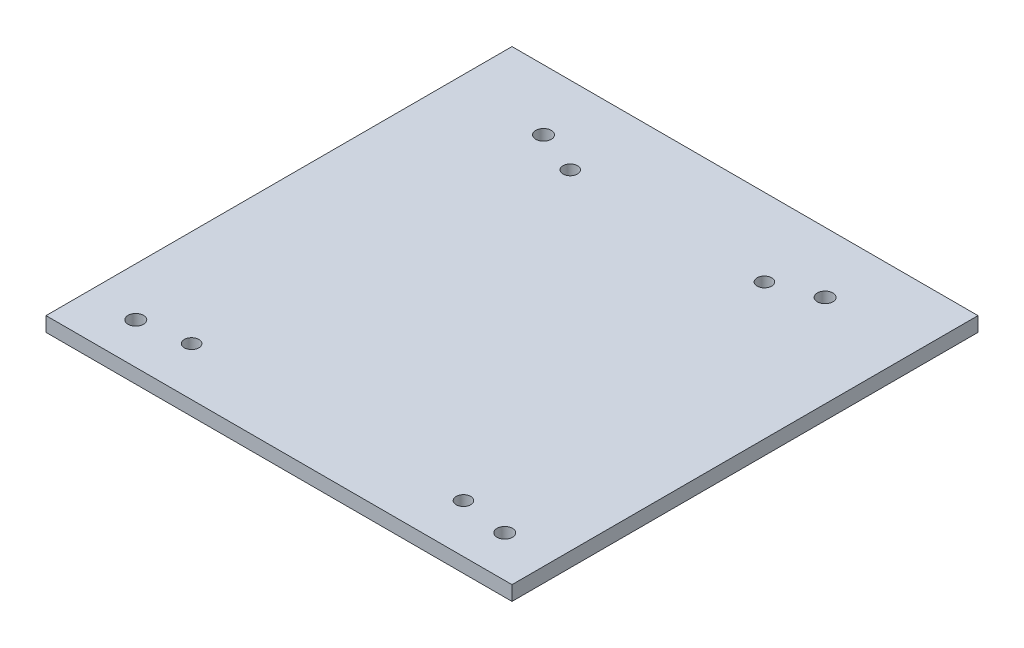
ISO-10303-21;
HEADER;
FILE_DESCRIPTION(('STEP AP214'),'2;1');
FILE_NAME('part.step','',(''),(''),'','','');
FILE_SCHEMA(('AUTOMOTIVE_DESIGN { 1 0 10303 214 1 1 1 1 }'));
ENDSEC;
DATA;
#1=APPLICATION_CONTEXT('core data for automotive mechanical design processes');
#2=APPLICATION_PROTOCOL_DEFINITION('international standard','automotive_design',2000,#1);
#3=PRODUCT_CONTEXT('',#1,'mechanical');
#4=PRODUCT('Part','Part','',(#3));
#5=PRODUCT_RELATED_PRODUCT_CATEGORY('part','',(#4));
#6=PRODUCT_DEFINITION_FORMATION('','',#4);
#7=PRODUCT_DEFINITION_CONTEXT('part definition',#1,'design');
#8=PRODUCT_DEFINITION('design','',#6,#7);
#9=PRODUCT_DEFINITION_SHAPE('','',#8);
#10=(LENGTH_UNIT() NAMED_UNIT(*) SI_UNIT(.MILLI.,.METRE.));
#11=(NAMED_UNIT(*) PLANE_ANGLE_UNIT() SI_UNIT($,.RADIAN.));
#12=(NAMED_UNIT(*) SI_UNIT($,.STERADIAN.) SOLID_ANGLE_UNIT());
#13=UNCERTAINTY_MEASURE_WITH_UNIT(LENGTH_MEASURE(1.E-05),#10,'distance_accuracy_value','');
#14=(GEOMETRIC_REPRESENTATION_CONTEXT(3) GLOBAL_UNCERTAINTY_ASSIGNED_CONTEXT((#13)) GLOBAL_UNIT_ASSIGNED_CONTEXT((#10,
#11,#12)) REPRESENTATION_CONTEXT('',''));
#15=CARTESIAN_POINT('',(0.,0.,0.));
#16=DIRECTION('',(0.,0.,1.));
#17=DIRECTION('',(1.,0.,0.));
#18=AXIS2_PLACEMENT_3D('',#15,#16,#17);
#19=CARTESIAN_POINT('',(0.,3.,0.));
#20=DIRECTION('',(0.,-1.,0.));
#21=DIRECTION('',(0.,0.,-1.));
#22=AXIS2_PLACEMENT_3D('',#19,#20,#21);
#23=PLANE('',#22);
#24=DIRECTION('',(0.,0.,1.));
#25=VECTOR('',#24,1.);
#26=CARTESIAN_POINT('',(0.,3.,0.));
#27=LINE('',#26,#25);
#28=CARTESIAN_POINT('',(0.,3.,-96.));
#29=VERTEX_POINT('',#28);
#30=CARTESIAN_POINT('',(0.,3.,0.));
#31=VERTEX_POINT('',#30);
#32=EDGE_CURVE('E92',#29,#31,#27,.T.);
#33=ORIENTED_EDGE('',*,*,#32,.T.);
#34=DIRECTION('',(1.,0.,0.));
#35=VECTOR('',#34,1.);
#36=CARTESIAN_POINT('',(0.,3.,0.));
#37=LINE('',#36,#35);
#38=CARTESIAN_POINT('',(96.,3.,0.));
#39=VERTEX_POINT('',#38);
#40=EDGE_CURVE('E87',#31,#39,#37,.T.);
#41=ORIENTED_EDGE('',*,*,#40,.T.);
#42=DIRECTION('',(0.,0.,-1.));
#43=VECTOR('',#42,1.);
#44=CARTESIAN_POINT('',(96.,3.,0.));
#45=LINE('',#44,#43);
#46=CARTESIAN_POINT('',(96.,3.,-96.));
#47=VERTEX_POINT('',#46);
#48=EDGE_CURVE('E90',#39,#47,#45,.T.);
#49=ORIENTED_EDGE('',*,*,#48,.T.);
#50=DIRECTION('',(-1.,0.,0.));
#51=VECTOR('',#50,1.);
#52=CARTESIAN_POINT('',(0.,3.,-96.));
#53=LINE('',#52,#51);
#54=EDGE_CURVE('E57',#47,#29,#53,.T.);
#55=ORIENTED_EDGE('',*,*,#54,.T.);
#56=EDGE_LOOP('',(#33,#41,#49,#55));
#57=FACE_BOUND('',#56,.T.);
#58=CARTESIAN_POINT('',(19.,3.,-83.5));
#59=DIRECTION('',(0.,1.,0.));
#60=DIRECTION('',(0.,0.,1.));
#61=AXIS2_PLACEMENT_3D('',#58,#59,#60);
#62=CIRCLE('',#61,1.60000000000001);
#63=CARTESIAN_POINT('',(19.,3.,-81.9));
#64=VERTEX_POINT('',#63);
#65=EDGE_CURVE('E112',#64,#64,#62,.T.);
#66=ORIENTED_EDGE('',*,*,#65,.F.);
#67=EDGE_LOOP('',(#66));
#68=FACE_BOUND('',#67,.T.);
#69=CARTESIAN_POINT('',(77.,3.,-83.5));
#70=DIRECTION('',(0.,1.,0.));
#71=DIRECTION('',(0.,0.,1.));
#72=AXIS2_PLACEMENT_3D('',#69,#70,#71);
#73=CIRCLE('',#72,1.60000000000001);
#74=CARTESIAN_POINT('',(77.,3.,-81.9));
#75=VERTEX_POINT('',#74);
#76=EDGE_CURVE('E134',#75,#75,#73,.T.);
#77=ORIENTED_EDGE('',*,*,#76,.F.);
#78=EDGE_LOOP('',(#77));
#79=FACE_BOUND('',#78,.T.);
#80=CARTESIAN_POINT('',(10.,3.,-8.50000000000001));
#81=DIRECTION('',(0.,1.,0.));
#82=DIRECTION('',(0.,0.,1.));
#83=AXIS2_PLACEMENT_3D('',#80,#81,#82);
#84=CIRCLE('',#83,1.6);
#85=CARTESIAN_POINT('',(10.,3.,-6.90000000000001));
#86=VERTEX_POINT('',#85);
#87=EDGE_CURVE('E142',#86,#86,#84,.T.);
#88=ORIENTED_EDGE('',*,*,#87,.F.);
#89=EDGE_LOOP('',(#88));
#90=FACE_BOUND('',#89,.T.);
#91=CARTESIAN_POINT('',(86.,3.,-8.50000000000001));
#92=DIRECTION('',(0.,1.,0.));
#93=DIRECTION('',(0.,0.,1.));
#94=AXIS2_PLACEMENT_3D('',#91,#92,#93);
#95=CIRCLE('',#94,1.6);
#96=CARTESIAN_POINT('',(86.,3.,-6.9));
#97=VERTEX_POINT('',#96);
#98=EDGE_CURVE('E150',#97,#97,#95,.T.);
#99=ORIENTED_EDGE('',*,*,#98,.F.);
#100=EDGE_LOOP('',(#99));
#101=FACE_BOUND('',#100,.T.);
#102=CARTESIAN_POINT('',(28.,3.,-80.));
#103=DIRECTION('',(0.,1.,0.));
#104=DIRECTION('',(0.,0.,1.));
#105=AXIS2_PLACEMENT_3D('',#102,#103,#104);
#106=CIRCLE('',#105,1.5);
#107=CARTESIAN_POINT('',(28.,3.,-78.5));
#108=VERTEX_POINT('',#107);
#109=EDGE_CURVE('E158',#108,#108,#106,.T.);
#110=ORIENTED_EDGE('',*,*,#109,.F.);
#111=EDGE_LOOP('',(#110));
#112=FACE_BOUND('',#111,.T.);
#113=CARTESIAN_POINT('',(68.,3.,-80.));
#114=DIRECTION('',(0.,1.,0.));
#115=DIRECTION('',(0.,0.,1.));
#116=AXIS2_PLACEMENT_3D('',#113,#114,#115);
#117=CIRCLE('',#116,1.5);
#118=CARTESIAN_POINT('',(68.,3.,-78.5));
#119=VERTEX_POINT('',#118);
#120=EDGE_CURVE('E166',#119,#119,#117,.T.);
#121=ORIENTED_EDGE('',*,*,#120,.F.);
#122=EDGE_LOOP('',(#121));
#123=FACE_BOUND('',#122,.T.);
#124=CARTESIAN_POINT('',(20.,3.,-10.));
#125=DIRECTION('',(0.,1.,0.));
#126=DIRECTION('',(0.,0.,1.));
#127=AXIS2_PLACEMENT_3D('',#124,#125,#126);
#128=CIRCLE('',#127,1.5);
#129=CARTESIAN_POINT('',(20.,3.,-8.49999999999999));
#130=VERTEX_POINT('',#129);
#131=EDGE_CURVE('E174',#130,#130,#128,.T.);
#132=ORIENTED_EDGE('',*,*,#131,.F.);
#133=EDGE_LOOP('',(#132));
#134=FACE_BOUND('',#133,.T.);
#135=CARTESIAN_POINT('',(76.,3.,-10.));
#136=DIRECTION('',(0.,1.,0.));
#137=DIRECTION('',(0.,0.,1.));
#138=AXIS2_PLACEMENT_3D('',#135,#136,#137);
#139=CIRCLE('',#138,1.5);
#140=CARTESIAN_POINT('',(76.,3.,-8.5));
#141=VERTEX_POINT('',#140);
#142=EDGE_CURVE('E182',#141,#141,#139,.T.);
#143=ORIENTED_EDGE('',*,*,#142,.F.);
#144=EDGE_LOOP('',(#143));
#145=FACE_BOUND('',#144,.T.);
#146=ADVANCED_FACE('F39',(#57,#68,#79,#90,#101,#112,#123,#134,#145),#23,.F.);
#147=CARTESIAN_POINT('',(0.,0.,0.));
#148=DIRECTION('',(0.,-1.,0.));
#149=DIRECTION('',(0.,0.,-1.));
#150=AXIS2_PLACEMENT_3D('',#147,#148,#149);
#151=PLANE('',#150);
#152=CARTESIAN_POINT('',(20.,0.,-10.));
#153=DIRECTION('',(0.,1.,0.));
#154=DIRECTION('',(0.,0.,1.));
#155=AXIS2_PLACEMENT_3D('',#152,#153,#154);
#156=CIRCLE('',#155,1.5);
#157=CARTESIAN_POINT('',(20.,0.,-8.49999999999999));
#158=VERTEX_POINT('',#157);
#159=EDGE_CURVE('E178',#158,#158,#156,.T.);
#160=ORIENTED_EDGE('',*,*,#159,.T.);
#161=EDGE_LOOP('',(#160));
#162=FACE_BOUND('',#161,.T.);
#163=CARTESIAN_POINT('',(28.,0.,-80.));
#164=DIRECTION('',(0.,1.,0.));
#165=DIRECTION('',(0.,0.,1.));
#166=AXIS2_PLACEMENT_3D('',#163,#164,#165);
#167=CIRCLE('',#166,1.5);
#168=CARTESIAN_POINT('',(28.,0.,-78.5));
#169=VERTEX_POINT('',#168);
#170=EDGE_CURVE('E162',#169,#169,#167,.T.);
#171=ORIENTED_EDGE('',*,*,#170,.T.);
#172=EDGE_LOOP('',(#171));
#173=FACE_BOUND('',#172,.T.);
#174=CARTESIAN_POINT('',(10.,0.,-8.50000000000001));
#175=DIRECTION('',(0.,1.,0.));
#176=DIRECTION('',(0.,0.,1.));
#177=AXIS2_PLACEMENT_3D('',#174,#175,#176);
#178=CIRCLE('',#177,1.6);
#179=CARTESIAN_POINT('',(10.,0.,-6.90000000000001));
#180=VERTEX_POINT('',#179);
#181=EDGE_CURVE('E146',#180,#180,#178,.T.);
#182=ORIENTED_EDGE('',*,*,#181,.T.);
#183=EDGE_LOOP('',(#182));
#184=FACE_BOUND('',#183,.T.);
#185=CARTESIAN_POINT('',(19.,0.,-83.5));
#186=DIRECTION('',(0.,1.,0.));
#187=DIRECTION('',(0.,0.,1.));
#188=AXIS2_PLACEMENT_3D('',#185,#186,#187);
#189=CIRCLE('',#188,1.60000000000001);
#190=CARTESIAN_POINT('',(19.,0.,-81.9));
#191=VERTEX_POINT('',#190);
#192=EDGE_CURVE('E130',#191,#191,#189,.T.);
#193=ORIENTED_EDGE('',*,*,#192,.T.);
#194=EDGE_LOOP('',(#193));
#195=FACE_BOUND('',#194,.T.);
#196=DIRECTION('',(0.,0.,1.));
#197=VECTOR('',#196,1.);
#198=CARTESIAN_POINT('',(0.,0.,0.));
#199=LINE('',#198,#197);
#200=CARTESIAN_POINT('',(0.,0.,-96.));
#201=VERTEX_POINT('',#200);
#202=CARTESIAN_POINT('',(0.,0.,0.));
#203=VERTEX_POINT('',#202);
#204=EDGE_CURVE('E108',#201,#203,#199,.T.);
#205=ORIENTED_EDGE('',*,*,#204,.F.);
#206=DIRECTION('',(-1.,0.,0.));
#207=VECTOR('',#206,1.);
#208=CARTESIAN_POINT('',(0.,0.,-96.));
#209=LINE('',#208,#207);
#210=CARTESIAN_POINT('',(96.,0.,-96.));
#211=VERTEX_POINT('',#210);
#212=EDGE_CURVE('E80',#211,#201,#209,.T.);
#213=ORIENTED_EDGE('',*,*,#212,.F.);
#214=DIRECTION('',(0.,0.,-1.));
#215=VECTOR('',#214,1.);
#216=CARTESIAN_POINT('',(96.,0.,0.));
#217=LINE('',#216,#215);
#218=CARTESIAN_POINT('',(96.,0.,0.));
#219=VERTEX_POINT('',#218);
#220=EDGE_CURVE('E74',#219,#211,#217,.T.);
#221=ORIENTED_EDGE('',*,*,#220,.F.);
#222=DIRECTION('',(1.,0.,0.));
#223=VECTOR('',#222,1.);
#224=CARTESIAN_POINT('',(0.,0.,0.));
#225=LINE('',#224,#223);
#226=EDGE_CURVE('E97',#203,#219,#225,.T.);
#227=ORIENTED_EDGE('',*,*,#226,.F.);
#228=EDGE_LOOP('',(#205,#213,#221,#227));
#229=FACE_BOUND('',#228,.T.);
#230=CARTESIAN_POINT('',(77.,0.,-83.5));
#231=DIRECTION('',(0.,1.,0.));
#232=DIRECTION('',(0.,0.,1.));
#233=AXIS2_PLACEMENT_3D('',#230,#231,#232);
#234=CIRCLE('',#233,1.60000000000001);
#235=CARTESIAN_POINT('',(77.,0.,-81.9));
#236=VERTEX_POINT('',#235);
#237=EDGE_CURVE('E138',#236,#236,#234,.T.);
#238=ORIENTED_EDGE('',*,*,#237,.T.);
#239=EDGE_LOOP('',(#238));
#240=FACE_BOUND('',#239,.T.);
#241=CARTESIAN_POINT('',(86.,0.,-8.50000000000001));
#242=DIRECTION('',(0.,1.,0.));
#243=DIRECTION('',(0.,0.,1.));
#244=AXIS2_PLACEMENT_3D('',#241,#242,#243);
#245=CIRCLE('',#244,1.6);
#246=CARTESIAN_POINT('',(86.,0.,-6.9));
#247=VERTEX_POINT('',#246);
#248=EDGE_CURVE('E154',#247,#247,#245,.T.);
#249=ORIENTED_EDGE('',*,*,#248,.T.);
#250=EDGE_LOOP('',(#249));
#251=FACE_BOUND('',#250,.T.);
#252=CARTESIAN_POINT('',(68.,0.,-80.));
#253=DIRECTION('',(0.,1.,0.));
#254=DIRECTION('',(0.,0.,1.));
#255=AXIS2_PLACEMENT_3D('',#252,#253,#254);
#256=CIRCLE('',#255,1.5);
#257=CARTESIAN_POINT('',(68.,0.,-78.5));
#258=VERTEX_POINT('',#257);
#259=EDGE_CURVE('E170',#258,#258,#256,.T.);
#260=ORIENTED_EDGE('',*,*,#259,.T.);
#261=EDGE_LOOP('',(#260));
#262=FACE_BOUND('',#261,.T.);
#263=CARTESIAN_POINT('',(76.,0.,-10.));
#264=DIRECTION('',(0.,1.,0.));
#265=DIRECTION('',(0.,0.,1.));
#266=AXIS2_PLACEMENT_3D('',#263,#264,#265);
#267=CIRCLE('',#266,1.5);
#268=CARTESIAN_POINT('',(76.,0.,-8.5));
#269=VERTEX_POINT('',#268);
#270=EDGE_CURVE('E186',#269,#269,#267,.T.);
#271=ORIENTED_EDGE('',*,*,#270,.T.);
#272=EDGE_LOOP('',(#271));
#273=FACE_BOUND('',#272,.T.);
#274=ADVANCED_FACE('F125',(#162,#173,#184,#195,#229,#240,#251,#262,#273),#151,.T.);
#275=CARTESIAN_POINT('',(0.,3.,0.));
#276=DIRECTION('',(1.,0.,0.));
#277=DIRECTION('',(0.,0.,-1.));
#278=AXIS2_PLACEMENT_3D('',#275,#276,#277);
#279=PLANE('',#278);
#280=ORIENTED_EDGE('',*,*,#204,.T.);
#281=DIRECTION('',(0.,-1.,0.));
#282=VECTOR('',#281,1.);
#283=CARTESIAN_POINT('',(0.,3.,0.));
#284=LINE('',#283,#282);
#285=EDGE_CURVE('E11',#31,#203,#284,.T.);
#286=ORIENTED_EDGE('',*,*,#285,.F.);
#287=ORIENTED_EDGE('',*,*,#32,.F.);
#288=DIRECTION('',(0.,-1.,0.));
#289=VECTOR('',#288,1.);
#290=CARTESIAN_POINT('',(0.,3.,-96.));
#291=LINE('',#290,#289);
#292=EDGE_CURVE('E104',#29,#201,#291,.T.);
#293=ORIENTED_EDGE('',*,*,#292,.T.);
#294=EDGE_LOOP('',(#280,#286,#287,#293));
#295=FACE_BOUND('',#294,.T.);
#296=ADVANCED_FACE('F41',(#295),#279,.F.);
#297=CARTESIAN_POINT('',(0.,3.,0.));
#298=DIRECTION('',(0.,0.,-1.));
#299=DIRECTION('',(-1.,0.,0.));
#300=AXIS2_PLACEMENT_3D('',#297,#298,#299);
#301=PLANE('',#300);
#302=ORIENTED_EDGE('',*,*,#226,.T.);
#303=DIRECTION('',(0.,-1.,0.));
#304=VECTOR('',#303,1.);
#305=CARTESIAN_POINT('',(96.,3.,0.));
#306=LINE('',#305,#304);
#307=EDGE_CURVE('E49',#39,#219,#306,.T.);
#308=ORIENTED_EDGE('',*,*,#307,.F.);
#309=ORIENTED_EDGE('',*,*,#40,.F.);
#310=ORIENTED_EDGE('',*,*,#285,.T.);
#311=EDGE_LOOP('',(#302,#308,#309,#310));
#312=FACE_BOUND('',#311,.T.);
#313=ADVANCED_FACE('F96',(#312),#301,.F.);
#314=CARTESIAN_POINT('',(96.,3.,0.));
#315=DIRECTION('',(-1.,0.,0.));
#316=DIRECTION('',(0.,0.,1.));
#317=AXIS2_PLACEMENT_3D('',#314,#315,#316);
#318=PLANE('',#317);
#319=ORIENTED_EDGE('',*,*,#220,.T.);
#320=DIRECTION('',(0.,-1.,0.));
#321=VECTOR('',#320,1.);
#322=CARTESIAN_POINT('',(96.,3.,-96.));
#323=LINE('',#322,#321);
#324=EDGE_CURVE('E99',#47,#211,#323,.T.);
#325=ORIENTED_EDGE('',*,*,#324,.F.);
#326=ORIENTED_EDGE('',*,*,#48,.F.);
#327=ORIENTED_EDGE('',*,*,#307,.T.);
#328=EDGE_LOOP('',(#319,#325,#326,#327));
#329=FACE_BOUND('',#328,.T.);
#330=ADVANCED_FACE('F100',(#329),#318,.F.);
#331=CARTESIAN_POINT('',(0.,3.,-96.));
#332=DIRECTION('',(0.,0.,1.));
#333=DIRECTION('',(1.,0.,0.));
#334=AXIS2_PLACEMENT_3D('',#331,#332,#333);
#335=PLANE('',#334);
#336=ORIENTED_EDGE('',*,*,#212,.T.);
#337=ORIENTED_EDGE('',*,*,#292,.F.);
#338=ORIENTED_EDGE('',*,*,#54,.F.);
#339=ORIENTED_EDGE('',*,*,#324,.T.);
#340=EDGE_LOOP('',(#336,#337,#338,#339));
#341=FACE_BOUND('',#340,.T.);
#342=ADVANCED_FACE('F122',(#341),#335,.F.);
#343=CARTESIAN_POINT('',(19.,3.,-83.5));
#344=DIRECTION('',(0.,-1.,0.));
#345=DIRECTION('',(0.,0.,-1.));
#346=AXIS2_PLACEMENT_3D('',#343,#344,#345);
#347=CYLINDRICAL_SURFACE('',#346,1.60000000000001);
#348=ORIENTED_EDGE('',*,*,#65,.T.);
#349=EDGE_LOOP('',(#348));
#350=FACE_BOUND('',#349,.T.);
#351=ORIENTED_EDGE('',*,*,#192,.F.);
#352=EDGE_LOOP('',(#351));
#353=FACE_BOUND('',#352,.T.);
#354=ADVANCED_FACE('F205',(#350,#353),#347,.F.);
#355=CARTESIAN_POINT('',(77.,3.,-83.5));
#356=DIRECTION('',(0.,-1.,0.));
#357=DIRECTION('',(0.,0.,-1.));
#358=AXIS2_PLACEMENT_3D('',#355,#356,#357);
#359=CYLINDRICAL_SURFACE('',#358,1.60000000000001);
#360=ORIENTED_EDGE('',*,*,#76,.T.);
#361=EDGE_LOOP('',(#360));
#362=FACE_BOUND('',#361,.T.);
#363=ORIENTED_EDGE('',*,*,#237,.F.);
#364=EDGE_LOOP('',(#363));
#365=FACE_BOUND('',#364,.T.);
#366=ADVANCED_FACE('F251',(#362,#365),#359,.F.);
#367=CARTESIAN_POINT('',(10.,3.,-8.50000000000001));
#368=DIRECTION('',(0.,-1.,0.));
#369=DIRECTION('',(0.,0.,-1.));
#370=AXIS2_PLACEMENT_3D('',#367,#368,#369);
#371=CYLINDRICAL_SURFACE('',#370,1.6);
#372=ORIENTED_EDGE('',*,*,#87,.T.);
#373=EDGE_LOOP('',(#372));
#374=FACE_BOUND('',#373,.T.);
#375=ORIENTED_EDGE('',*,*,#181,.F.);
#376=EDGE_LOOP('',(#375));
#377=FACE_BOUND('',#376,.T.);
#378=ADVANCED_FACE('F259',(#374,#377),#371,.F.);
#379=CARTESIAN_POINT('',(86.,3.,-8.50000000000001));
#380=DIRECTION('',(0.,-1.,0.));
#381=DIRECTION('',(0.,0.,-1.));
#382=AXIS2_PLACEMENT_3D('',#379,#380,#381);
#383=CYLINDRICAL_SURFACE('',#382,1.6);
#384=ORIENTED_EDGE('',*,*,#98,.T.);
#385=EDGE_LOOP('',(#384));
#386=FACE_BOUND('',#385,.T.);
#387=ORIENTED_EDGE('',*,*,#248,.F.);
#388=EDGE_LOOP('',(#387));
#389=FACE_BOUND('',#388,.T.);
#390=ADVANCED_FACE('F267',(#386,#389),#383,.F.);
#391=CARTESIAN_POINT('',(28.,3.,-80.));
#392=DIRECTION('',(0.,-1.,0.));
#393=DIRECTION('',(0.,0.,-1.));
#394=AXIS2_PLACEMENT_3D('',#391,#392,#393);
#395=CYLINDRICAL_SURFACE('',#394,1.5);
#396=ORIENTED_EDGE('',*,*,#109,.T.);
#397=EDGE_LOOP('',(#396));
#398=FACE_BOUND('',#397,.T.);
#399=ORIENTED_EDGE('',*,*,#170,.F.);
#400=EDGE_LOOP('',(#399));
#401=FACE_BOUND('',#400,.T.);
#402=ADVANCED_FACE('F276',(#398,#401),#395,.F.);
#403=CARTESIAN_POINT('',(68.,3.,-80.));
#404=DIRECTION('',(0.,-1.,0.));
#405=DIRECTION('',(0.,0.,-1.));
#406=AXIS2_PLACEMENT_3D('',#403,#404,#405);
#407=CYLINDRICAL_SURFACE('',#406,1.5);
#408=ORIENTED_EDGE('',*,*,#120,.T.);
#409=EDGE_LOOP('',(#408));
#410=FACE_BOUND('',#409,.T.);
#411=ORIENTED_EDGE('',*,*,#259,.F.);
#412=EDGE_LOOP('',(#411));
#413=FACE_BOUND('',#412,.T.);
#414=ADVANCED_FACE('F285',(#410,#413),#407,.F.);
#415=CARTESIAN_POINT('',(20.,3.,-10.));
#416=DIRECTION('',(0.,-1.,0.));
#417=DIRECTION('',(0.,0.,-1.));
#418=AXIS2_PLACEMENT_3D('',#415,#416,#417);
#419=CYLINDRICAL_SURFACE('',#418,1.5);
#420=ORIENTED_EDGE('',*,*,#131,.T.);
#421=EDGE_LOOP('',(#420));
#422=FACE_BOUND('',#421,.T.);
#423=ORIENTED_EDGE('',*,*,#159,.F.);
#424=EDGE_LOOP('',(#423));
#425=FACE_BOUND('',#424,.T.);
#426=ADVANCED_FACE('F294',(#422,#425),#419,.F.);
#427=CARTESIAN_POINT('',(76.,3.,-10.));
#428=DIRECTION('',(0.,-1.,0.));
#429=DIRECTION('',(0.,0.,-1.));
#430=AXIS2_PLACEMENT_3D('',#427,#428,#429);
#431=CYLINDRICAL_SURFACE('',#430,1.5);
#432=ORIENTED_EDGE('',*,*,#142,.T.);
#433=EDGE_LOOP('',(#432));
#434=FACE_BOUND('',#433,.T.);
#435=ORIENTED_EDGE('',*,*,#270,.F.);
#436=EDGE_LOOP('',(#435));
#437=FACE_BOUND('',#436,.T.);
#438=ADVANCED_FACE('F194',(#434,#437),#431,.F.);
#439=CLOSED_SHELL('',(#146,#274,#296,#313,#330,#342,#354,#366,#378,#390,#402,#414,#426,#438));
#440=MANIFOLD_SOLID_BREP('B2',#439);
#441=ADVANCED_BREP_SHAPE_REPRESENTATION('',(#18,#440),#14);
#442=SHAPE_DEFINITION_REPRESENTATION(#9,#441);
ENDSEC;
END-ISO-10303-21;
